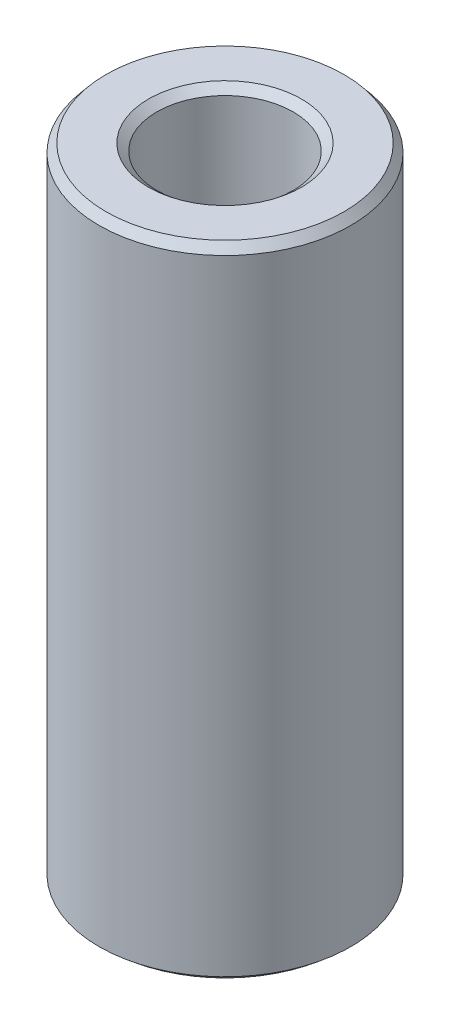
ISO-10303-21;
HEADER;
FILE_DESCRIPTION(('STEP AP214'),'2;1');
FILE_NAME('part.step','',(''),(''),'','','');
FILE_SCHEMA(('AUTOMOTIVE_DESIGN { 1 0 10303 214 1 1 1 1 }'));
ENDSEC;
DATA;
#1=APPLICATION_CONTEXT('core data for automotive mechanical design processes');
#2=APPLICATION_PROTOCOL_DEFINITION('international standard','automotive_design',2000,#1);
#3=PRODUCT_CONTEXT('',#1,'mechanical');
#4=PRODUCT('Part','Part','',(#3));
#5=PRODUCT_RELATED_PRODUCT_CATEGORY('part','',(#4));
#6=PRODUCT_DEFINITION_FORMATION('','',#4);
#7=PRODUCT_DEFINITION_CONTEXT('part definition',#1,'design');
#8=PRODUCT_DEFINITION('design','',#6,#7);
#9=PRODUCT_DEFINITION_SHAPE('','',#8);
#10=(LENGTH_UNIT() NAMED_UNIT(*) SI_UNIT(.MILLI.,.METRE.));
#11=(NAMED_UNIT(*) PLANE_ANGLE_UNIT() SI_UNIT($,.RADIAN.));
#12=(NAMED_UNIT(*) SI_UNIT($,.STERADIAN.) SOLID_ANGLE_UNIT());
#13=UNCERTAINTY_MEASURE_WITH_UNIT(LENGTH_MEASURE(1.E-05),#10,'distance_accuracy_value','');
#14=(GEOMETRIC_REPRESENTATION_CONTEXT(3) GLOBAL_UNCERTAINTY_ASSIGNED_CONTEXT((#13)) GLOBAL_UNIT_ASSIGNED_CONTEXT((#10,
#11,#12)) REPRESENTATION_CONTEXT('',''));
#15=CARTESIAN_POINT('',(0.,0.,0.));
#16=DIRECTION('',(0.,0.,1.));
#17=DIRECTION('',(1.,0.,0.));
#18=AXIS2_PLACEMENT_3D('',#15,#16,#17);
#19=CARTESIAN_POINT('',(0.,254.135357599273,0.));
#20=DIRECTION('',(0.,-1.,0.));
#21=DIRECTION('',(0.,0.,-1.));
#22=AXIS2_PLACEMENT_3D('',#19,#20,#21);
#23=CYLINDRICAL_SURFACE('',#22,50.);
#24=CARTESIAN_POINT('',(0.,2.76329870562664,0.));
#25=DIRECTION('',(0.,1.,0.));
#26=DIRECTION('',(0.,0.,1.));
#27=AXIS2_PLACEMENT_3D('',#24,#25,#26);
#28=CIRCLE('',#27,50.);
#29=CARTESIAN_POINT('',(0.,2.76329870562664,50.));
#30=VERTEX_POINT('',#29);
#31=EDGE_CURVE('E10',#30,#30,#28,.T.);
#32=ORIENTED_EDGE('',*,*,#31,.T.);
#33=EDGE_LOOP('',(#32));
#34=FACE_BOUND('',#33,.T.);
#35=CARTESIAN_POINT('',(0.,250.812853279365,0.));
#36=DIRECTION('',(0.,1.,0.));
#37=DIRECTION('',(0.,0.,1.));
#38=AXIS2_PLACEMENT_3D('',#35,#36,#37);
#39=CIRCLE('',#38,50.);
#40=CARTESIAN_POINT('',(0.,250.812853279365,50.));
#41=VERTEX_POINT('',#40);
#42=EDGE_CURVE('E50',#41,#41,#39,.F.);
#43=ORIENTED_EDGE('',*,*,#42,.T.);
#44=EDGE_LOOP('',(#43));
#45=FACE_BOUND('',#44,.T.);
#46=ADVANCED_FACE('F39',(#34,#45),#23,.T.);
#47=CARTESIAN_POINT('',(0.,254.135357599273,0.));
#48=DIRECTION('',(0.,1.,0.));
#49=DIRECTION('',(0.,0.,1.));
#50=AXIS2_PLACEMENT_3D('',#47,#48,#49);
#51=PLANE('',#50);
#52=CARTESIAN_POINT('',(0.,254.135357599273,0.));
#53=DIRECTION('',(0.,1.,0.));
#54=DIRECTION('',(0.,0.,1.));
#55=AXIS2_PLACEMENT_3D('',#52,#53,#54);
#56=CIRCLE('',#55,30.3799062770461);
#57=CARTESIAN_POINT('',(0.,254.135357599273,30.3799062770461));
#58=VERTEX_POINT('',#57);
#59=EDGE_CURVE('E58',#58,#58,#56,.F.);
#60=ORIENTED_EDGE('',*,*,#59,.T.);
#61=EDGE_LOOP('',(#60));
#62=FACE_BOUND('',#61,.T.);
#63=CARTESIAN_POINT('',(0.,254.135357599273,0.));
#64=DIRECTION('',(0.,1.,0.));
#65=DIRECTION('',(0.,0.,1.));
#66=AXIS2_PLACEMENT_3D('',#63,#64,#65);
#67=CIRCLE('',#66,47.2367012943735);
#68=CARTESIAN_POINT('',(0.,254.135357599273,47.2367012943735));
#69=VERTEX_POINT('',#68);
#70=EDGE_CURVE('E61',#69,#69,#67,.T.);
#71=ORIENTED_EDGE('',*,*,#70,.T.);
#72=EDGE_LOOP('',(#71));
#73=FACE_BOUND('',#72,.T.);
#74=ADVANCED_FACE('F88',(#62,#73),#51,.T.);
#75=CARTESIAN_POINT('',(0.,0.,0.));
#76=DIRECTION('',(0.,1.,0.));
#77=DIRECTION('',(0.,0.,1.));
#78=AXIS2_PLACEMENT_3D('',#75,#76,#77);
#79=PLANE('',#78);
#80=CARTESIAN_POINT('',(0.,0.,0.));
#81=DIRECTION('',(0.,1.,0.));
#82=DIRECTION('',(0.,0.,1.));
#83=AXIS2_PLACEMENT_3D('',#80,#81,#82);
#84=CIRCLE('',#83,29.8207006627647);
#85=CARTESIAN_POINT('',(0.,0.,-29.8207006627647));
#86=VERTEX_POINT('',#85);
#87=EDGE_CURVE('E51',#86,#86,#84,.T.);
#88=ORIENTED_EDGE('',*,*,#87,.T.);
#89=EDGE_LOOP('',(#88));
#90=FACE_BOUND('',#89,.T.);
#91=CARTESIAN_POINT('',(0.,0.,0.));
#92=DIRECTION('',(0.,1.,0.));
#93=DIRECTION('',(0.,0.,1.));
#94=AXIS2_PLACEMENT_3D('',#91,#92,#93);
#95=CIRCLE('',#94,46.677495680092);
#96=CARTESIAN_POINT('',(0.,0.,46.677495680092));
#97=VERTEX_POINT('',#96);
#98=EDGE_CURVE('E54',#97,#97,#95,.F.);
#99=ORIENTED_EDGE('',*,*,#98,.T.);
#100=EDGE_LOOP('',(#99));
#101=FACE_BOUND('',#100,.T.);
#102=ADVANCED_FACE('F83',(#90,#101),#79,.F.);
#103=CARTESIAN_POINT('',(0.,254.135357599273,0.));
#104=DIRECTION('',(0.,-1.,0.));
#105=DIRECTION('',(0.,0.,-1.));
#106=AXIS2_PLACEMENT_3D('',#103,#104,#105);
#107=CYLINDRICAL_SURFACE('',#106,27.057401957138);
#108=CARTESIAN_POINT('',(0.,251.372058893647,0.));
#109=DIRECTION('',(0.,1.,0.));
#110=DIRECTION('',(0.,0.,1.));
#111=AXIS2_PLACEMENT_3D('',#108,#109,#110);
#112=CIRCLE('',#111,27.057401957138);
#113=CARTESIAN_POINT('',(0.,251.372058893647,27.057401957138));
#114=VERTEX_POINT('',#113);
#115=EDGE_CURVE('E67',#114,#114,#112,.T.);
#116=ORIENTED_EDGE('',*,*,#115,.T.);
#117=EDGE_LOOP('',(#116));
#118=FACE_BOUND('',#117,.T.);
#119=CARTESIAN_POINT('',(0.,3.3225043199081,0.));
#120=DIRECTION('',(0.,1.,0.));
#121=DIRECTION('',(0.,0.,1.));
#122=AXIS2_PLACEMENT_3D('',#119,#120,#121);
#123=CIRCLE('',#122,27.057401957138);
#124=CARTESIAN_POINT('',(0.,3.3225043199081,-27.057401957138));
#125=VERTEX_POINT('',#124);
#126=EDGE_CURVE('E69',#125,#125,#123,.F.);
#127=ORIENTED_EDGE('',*,*,#126,.T.);
#128=EDGE_LOOP('',(#127));
#129=FACE_BOUND('',#128,.T.);
#130=ADVANCED_FACE('F71',(#118,#129),#107,.F.);
#131=CARTESIAN_POINT('',(0.,251.372058893647,0.));
#132=DIRECTION('',(0.,1.,0.));
#133=DIRECTION('',(0.,0.,1.));
#134=AXIS2_PLACEMENT_3D('',#131,#132,#133);
#135=CONICAL_SURFACE('',#134,27.057401957138,0.877027765623093);
#136=ORIENTED_EDGE('',*,*,#59,.F.);
#137=EDGE_LOOP('',(#136));
#138=FACE_BOUND('',#137,.T.);
#139=ORIENTED_EDGE('',*,*,#115,.F.);
#140=EDGE_LOOP('',(#139));
#141=FACE_BOUND('',#140,.T.);
#142=ADVANCED_FACE('F77',(#138,#141),#135,.F.);
#143=CARTESIAN_POINT('',(0.,0.,0.));
#144=DIRECTION('',(0.,-1.,0.));
#145=DIRECTION('',(0.,0.,-1.));
#146=AXIS2_PLACEMENT_3D('',#143,#144,#145);
#147=CONICAL_SURFACE('',#146,29.8207006627647,0.693768561171802);
#148=CARTESIAN_POINT('',(0.,3.3225043199081,-27.057401957138));
#149=CARTESIAN_POINT('',(0.,3.28789489990906,-27.086186318655));
#150=CARTESIAN_POINT('',(0.,3.25328547991002,-27.1149706801719));
#151=CARTESIAN_POINT('',(0.,3.18406663991193,-27.1725394032058));
#152=CARTESIAN_POINT('',(0.,3.14945721991289,-27.2013237647227));
#153=CARTESIAN_POINT('',(0.,3.0802383799148,-27.2588924877566));
#154=CARTESIAN_POINT('',(0.,3.04562895991576,-27.2876768492736));
#155=CARTESIAN_POINT('',(0.,2.97641011991768,-27.3452455723075));
#156=CARTESIAN_POINT('',(0.,2.94180069991863,-27.3740299338244));
#157=CARTESIAN_POINT('',(0.,2.87258185992055,-27.4315986568583));
#158=CARTESIAN_POINT('',(0.,2.8379724399215,-27.4603830183752));
#159=CARTESIAN_POINT('',(0.,2.76875359992342,-27.5179517414091));
#160=CARTESIAN_POINT('',(0.,2.73414417992438,-27.5467361029261));
#161=CARTESIAN_POINT('',(0.,2.66492533992629,-27.60430482596));
#162=CARTESIAN_POINT('',(0.,2.63031591992725,-27.6330891874769));
#163=CARTESIAN_POINT('',(0.,2.56109707992916,-27.6906579105108));
#164=CARTESIAN_POINT('',(0.,2.52648765993012,-27.7194422720277));
#165=CARTESIAN_POINT('',(0.,2.45726881993203,-27.7770109950616));
#166=CARTESIAN_POINT('',(0.,2.42265939993299,-27.8057953565786));
#167=CARTESIAN_POINT('',(0.,2.35344055993491,-27.8633640796125));
#168=CARTESIAN_POINT('',(0.,2.31883113993586,-27.8921484411294));
#169=CARTESIAN_POINT('',(0.,2.24961229993778,-27.9497171641633));
#170=CARTESIAN_POINT('',(0.,2.21500287993874,-27.9785015256802));
#171=CARTESIAN_POINT('',(0.,2.14578403994065,-28.0360702487141));
#172=CARTESIAN_POINT('',(0.,2.11117461994161,-28.0648546102311));
#173=CARTESIAN_POINT('',(0.,2.04195577994352,-28.122423333265));
#174=CARTESIAN_POINT('',(0.,2.00734635994448,-28.1512076947819));
#175=CARTESIAN_POINT('',(0.,1.93812751994639,-28.2087764178158));
#176=CARTESIAN_POINT('',(0.,1.90351809994735,-28.2375607793327));
#177=CARTESIAN_POINT('',(0.,1.83429925994927,-28.2951295023666));
#178=CARTESIAN_POINT('',(0.,1.79968983995022,-28.3239138638836));
#179=CARTESIAN_POINT('',(0.,1.73047099995214,-28.3814825869175));
#180=CARTESIAN_POINT('',(0.,1.69586157995309,-28.4102669484344));
#181=CARTESIAN_POINT('',(0.,1.62664273995501,-28.4678356714683));
#182=CARTESIAN_POINT('',(0.,1.59203331995597,-28.4966200329852));
#183=CARTESIAN_POINT('',(0.,1.52281447995788,-28.5541887560191));
#184=CARTESIAN_POINT('',(0.,1.48820505995884,-28.5829731175361));
#185=CARTESIAN_POINT('',(0.,1.41898621996075,-28.64054184057));
#186=CARTESIAN_POINT('',(0.,1.38437679996171,-28.6693262020869));
#187=CARTESIAN_POINT('',(0.,1.31515795996362,-28.7268949251208));
#188=CARTESIAN_POINT('',(0.,1.28054853996458,-28.7556792866377));
#189=CARTESIAN_POINT('',(0.,1.2113296999665,-28.8132480096716));
#190=CARTESIAN_POINT('',(0.,1.17672027996745,-28.8420323711886));
#191=CARTESIAN_POINT('',(0.,1.10750143996937,-28.8996010942225));
#192=CARTESIAN_POINT('',(0.,1.07289201997033,-28.9283854557394));
#193=CARTESIAN_POINT('',(0.,1.00367317997224,-28.9859541787733));
#194=CARTESIAN_POINT('',(0.,0.969063759973197,-29.0147385402902));
#195=CARTESIAN_POINT('',(0.,0.899844919975111,-29.0723072633241));
#196=CARTESIAN_POINT('',(0.,0.865235499976068,-29.1010916248411));
#197=CARTESIAN_POINT('',(0.,0.796016659977983,-29.158660347875));
#198=CARTESIAN_POINT('',(0.,0.761407239978941,-29.1874447093919));
#199=CARTESIAN_POINT('',(0.,0.692188399980855,-29.2450134324258));
#200=CARTESIAN_POINT('',(0.,0.657578979981812,-29.2737977939427));
#201=CARTESIAN_POINT('',(0.,0.588360139983727,-29.3313665169766));
#202=CARTESIAN_POINT('',(0.,0.553750719984684,-29.3601508784936));
#203=CARTESIAN_POINT('',(0.,0.484531879986598,-29.4177196015275));
#204=CARTESIAN_POINT('',(0.,0.449922459987556,-29.4465039630444));
#205=CARTESIAN_POINT('',(0.,0.38070361998947,-29.5040726860783));
#206=CARTESIAN_POINT('',(0.,0.346094199990427,-29.5328570475952));
#207=CARTESIAN_POINT('',(0.,0.276875359992342,-29.5904257706291));
#208=CARTESIAN_POINT('',(0.,0.242265939993299,-29.6192101321461));
#209=CARTESIAN_POINT('',(0.,0.173047099995214,-29.67677885518));
#210=CARTESIAN_POINT('',(0.,0.138437679996171,-29.7055632166969));
#211=CARTESIAN_POINT('',(0.,0.0692188399980853,-29.7631319397308));
#212=CARTESIAN_POINT('',(0.,0.0346094199990424,-29.7919163012477));
#213=CARTESIAN_POINT('',(0.,0.,-29.8207006627647));
#214=B_SPLINE_CURVE_WITH_KNOTS('',3,(#148,#149,#150,#151,#152,#153,#154,#155,#156,#157,#158,
#159,#160,#161,#162,#163,#164,#165,#166,#167,#168,#169,#170,#171,#172,#173,#174,#175,#176,#177,
#178,#179,#180,#181,#182,#183,#184,#185,#186,#187,#188,#189,#190,#191,#192,#193,#194,#195,#196,
#197,#198,#199,#200,#201,#202,#203,#204,#205,#206,#207,#208,#209,#210,#211,#212,#213),
.UNSPECIFIED.,.F.,.F.,(4,2,2,2,2,2,2,2,2,2,2,2,2,2,2,2,2,2,2,2,2,2,2,2,2,2,2,2,2,2,2,2,4),(0.,
0.135045039840323,0.270090079680646,0.405135119520972,0.540180159361295,0.675225199201618,
0.810270239041941,0.945315278882264,1.08036031872259,1.21540535856291,1.35045039840324,
1.48549543824356,1.62054047808388,1.75558551792421,1.89063055776453,2.02567559760485,
2.16072063744518,2.2957656772855,2.43081071712582,2.56585575696615,2.70090079680647,
2.8359458366468,2.97099087648712,3.10603591632744,3.24108095616777,3.37612599600809,
3.51117103584841,3.64621607568874,3.78126111552906,3.91630615536938,4.05135119520971,
4.18639623505003,4.32144127489036),.UNSPECIFIED.);
#215=EDGE_CURVE('BSEAM73',#125,#86,#214,.T.);
#216=ORIENTED_EDGE('',*,*,#126,.F.);
#217=ORIENTED_EDGE('',*,*,#87,.F.);
#218=ORIENTED_EDGE('',*,*,#215,.T.);
#219=ORIENTED_EDGE('',*,*,#215,.F.);
#220=EDGE_LOOP('',(#216,#218,#217,#219));
#221=FACE_BOUND('',#220,.T.);
#222=ADVANCED_FACE('F73',(#221),#147,.F.);
#223=CARTESIAN_POINT('',(0.,2.76329870562664,0.));
#224=DIRECTION('',(0.,1.,0.));
#225=DIRECTION('',(0.,0.,1.));
#226=AXIS2_PLACEMENT_3D('',#223,#224,#225);
#227=CONICAL_SURFACE('',#226,50.,0.877027765623087);
#228=ORIENTED_EDGE('',*,*,#98,.F.);
#229=EDGE_LOOP('',(#228));
#230=FACE_BOUND('',#229,.T.);
#231=ORIENTED_EDGE('',*,*,#31,.F.);
#232=EDGE_LOOP('',(#231));
#233=FACE_BOUND('',#232,.T.);
#234=ADVANCED_FACE('F76',(#230,#233),#227,.T.);
#235=CARTESIAN_POINT('',(0.,254.135357599273,0.));
#236=DIRECTION('',(0.,-1.,0.));
#237=DIRECTION('',(0.,0.,-1.));
#238=AXIS2_PLACEMENT_3D('',#235,#236,#237);
#239=CONICAL_SURFACE('',#238,47.2367012943735,0.693768561171797);
#240=ORIENTED_EDGE('',*,*,#42,.F.);
#241=EDGE_LOOP('',(#240));
#242=FACE_BOUND('',#241,.T.);
#243=ORIENTED_EDGE('',*,*,#70,.F.);
#244=EDGE_LOOP('',(#243));
#245=FACE_BOUND('',#244,.T.);
#246=ADVANCED_FACE('F45',(#242,#245),#239,.T.);
#247=CLOSED_SHELL('',(#46,#74,#102,#130,#142,#222,#234,#246));
#248=MANIFOLD_SOLID_BREP('B2',#247);
#249=ADVANCED_BREP_SHAPE_REPRESENTATION('',(#18,#248),#14);
#250=SHAPE_DEFINITION_REPRESENTATION(#9,#249);
ENDSEC;
END-ISO-10303-21;
